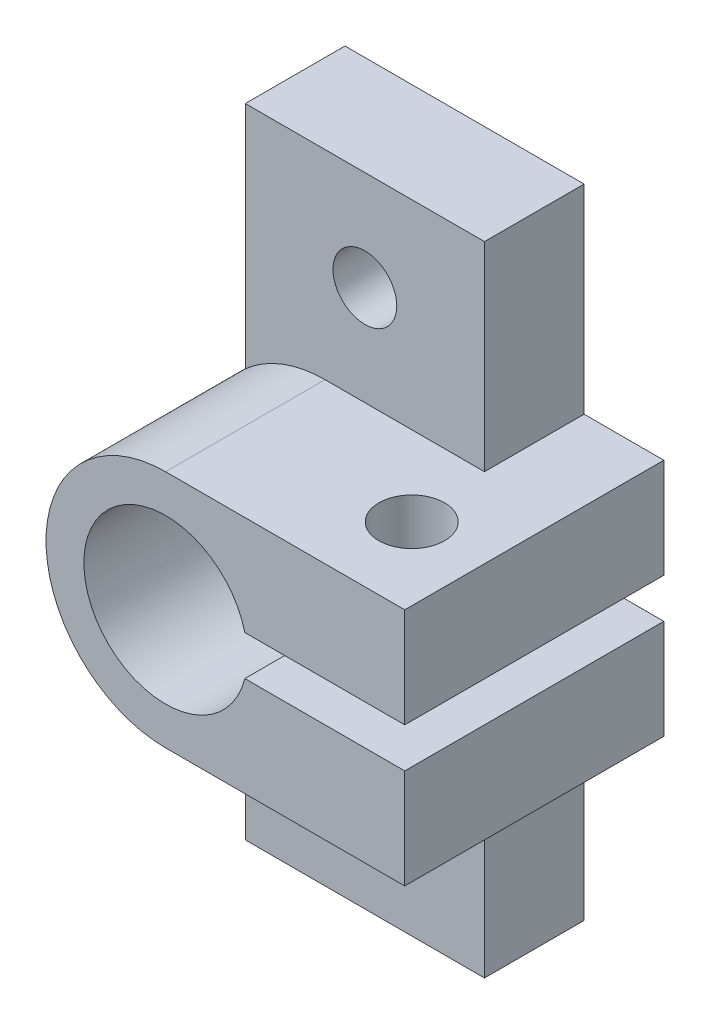
ISO-10303-21;
HEADER;
FILE_DESCRIPTION(('STEP AP214'),'2;1');
FILE_NAME('part.step','',(''),(''),'','','');
FILE_SCHEMA(('AUTOMOTIVE_DESIGN { 1 0 10303 214 1 1 1 1 }'));
ENDSEC;
DATA;
#1=APPLICATION_CONTEXT('core data for automotive mechanical design processes');
#2=APPLICATION_PROTOCOL_DEFINITION('international standard','automotive_design',2000,#1);
#3=PRODUCT_CONTEXT('',#1,'mechanical');
#4=PRODUCT('Part','Part','',(#3));
#5=PRODUCT_RELATED_PRODUCT_CATEGORY('part','',(#4));
#6=PRODUCT_DEFINITION_FORMATION('','',#4);
#7=PRODUCT_DEFINITION_CONTEXT('part definition',#1,'design');
#8=PRODUCT_DEFINITION('design','',#6,#7);
#9=PRODUCT_DEFINITION_SHAPE('','',#8);
#10=(LENGTH_UNIT() NAMED_UNIT(*) SI_UNIT(.MILLI.,.METRE.));
#11=(NAMED_UNIT(*) PLANE_ANGLE_UNIT() SI_UNIT($,.RADIAN.));
#12=(NAMED_UNIT(*) SI_UNIT($,.STERADIAN.) SOLID_ANGLE_UNIT());
#13=UNCERTAINTY_MEASURE_WITH_UNIT(LENGTH_MEASURE(1.E-05),#10,'distance_accuracy_value','');
#14=(GEOMETRIC_REPRESENTATION_CONTEXT(3) GLOBAL_UNCERTAINTY_ASSIGNED_CONTEXT((#13)) GLOBAL_UNIT_ASSIGNED_CONTEXT((#10,
#11,#12)) REPRESENTATION_CONTEXT('',''));
#15=CARTESIAN_POINT('',(0.,0.,0.));
#16=DIRECTION('',(0.,0.,1.));
#17=DIRECTION('',(1.,0.,0.));
#18=AXIS2_PLACEMENT_3D('',#15,#16,#17);
#19=CARTESIAN_POINT('',(0.,0.,0.));
#20=DIRECTION('',(0.,0.,1.));
#21=DIRECTION('',(1.,0.,0.));
#22=AXIS2_PLACEMENT_3D('',#19,#20,#21);
#23=CYLINDRICAL_SURFACE('',#22,6.);
#24=CARTESIAN_POINT('',(0.,0.,5.));
#25=DIRECTION('',(0.,0.,1.));
#26=DIRECTION('',(1.,0.,0.));
#27=AXIS2_PLACEMENT_3D('',#24,#25,#26);
#28=CIRCLE('',#27,6.);
#29=CARTESIAN_POINT('',(-4.,4.47213595499958,5.));
#30=VERTEX_POINT('',#29);
#31=CARTESIAN_POINT('',(0.,6.,5.));
#32=VERTEX_POINT('',#31);
#33=EDGE_CURVE('E49',#30,#32,#28,.F.);
#34=ORIENTED_EDGE('',*,*,#33,.F.);
#35=DIRECTION('',(0.,0.,1.));
#36=VECTOR('',#35,1.);
#37=CARTESIAN_POINT('',(-4.,4.47213595499958,0.));
#38=LINE('',#37,#36);
#39=CARTESIAN_POINT('',(-4.,4.47213595499958,0.));
#40=VERTEX_POINT('',#39);
#41=EDGE_CURVE('E11',#30,#40,#38,.F.);
#42=ORIENTED_EDGE('',*,*,#41,.T.);
#43=CARTESIAN_POINT('',(0.,0.,0.));
#44=DIRECTION('',(0.,0.,1.));
#45=DIRECTION('',(-1.,0.,0.));
#46=AXIS2_PLACEMENT_3D('',#43,#44,#45);
#47=CIRCLE('',#46,6.);
#48=CARTESIAN_POINT('',(-4.,-4.47213595499958,0.));
#49=VERTEX_POINT('',#48);
#50=EDGE_CURVE('E213',#40,#49,#47,.T.);
#51=ORIENTED_EDGE('',*,*,#50,.T.);
#52=DIRECTION('',(0.,0.,1.));
#53=VECTOR('',#52,1.);
#54=CARTESIAN_POINT('',(-4.,-4.47213595499958,0.));
#55=LINE('',#54,#53);
#56=CARTESIAN_POINT('',(-4.,-4.47213595499958,5.));
#57=VERTEX_POINT('',#56);
#58=EDGE_CURVE('E250',#57,#49,#55,.F.);
#59=ORIENTED_EDGE('',*,*,#58,.F.);
#60=CARTESIAN_POINT('',(0.,0.,5.));
#61=DIRECTION('',(0.,0.,1.));
#62=DIRECTION('',(1.,0.,0.));
#63=AXIS2_PLACEMENT_3D('',#60,#61,#62);
#64=CIRCLE('',#63,6.);
#65=CARTESIAN_POINT('',(0.,-6.,5.));
#66=VERTEX_POINT('',#65);
#67=EDGE_CURVE('E247',#57,#66,#64,.T.);
#68=ORIENTED_EDGE('',*,*,#67,.T.);
#69=DIRECTION('',(0.,0.,1.));
#70=VECTOR('',#69,1.);
#71=CARTESIAN_POINT('',(0.,-6.,0.));
#72=LINE('',#71,#70);
#73=CARTESIAN_POINT('',(0.,-6.,13.));
#74=VERTEX_POINT('',#73);
#75=EDGE_CURVE('E227',#66,#74,#72,.T.);
#76=ORIENTED_EDGE('',*,*,#75,.T.);
#77=CARTESIAN_POINT('',(0.,0.,13.));
#78=DIRECTION('',(0.,0.,1.));
#79=DIRECTION('',(-1.,0.,0.));
#80=AXIS2_PLACEMENT_3D('',#77,#78,#79);
#81=CIRCLE('',#80,6.);
#82=CARTESIAN_POINT('',(0.,6.,13.));
#83=VERTEX_POINT('',#82);
#84=EDGE_CURVE('E189',#83,#74,#81,.T.);
#85=ORIENTED_EDGE('',*,*,#84,.F.);
#86=DIRECTION('',(0.,0.,1.));
#87=VECTOR('',#86,1.);
#88=CARTESIAN_POINT('',(0.,6.,0.));
#89=LINE('',#88,#87);
#90=EDGE_CURVE('E228',#32,#83,#89,.T.);
#91=ORIENTED_EDGE('',*,*,#90,.F.);
#92=EDGE_LOOP('',(#34,#42,#51,#59,#68,#76,#85,#91));
#93=FACE_BOUND('',#92,.T.);
#94=ADVANCED_FACE('F34',(#93),#23,.T.);
#95=CARTESIAN_POINT('',(12.,6.,0.));
#96=DIRECTION('',(0.,1.,0.));
#97=DIRECTION('',(-1.,0.,0.));
#98=AXIS2_PLACEMENT_3D('',#95,#96,#97);
#99=PLANE('',#98);
#100=CARTESIAN_POINT('',(8.35,6.,9.));
#101=DIRECTION('',(0.,1.,0.));
#102=DIRECTION('',(-1.,0.,0.));
#103=AXIS2_PLACEMENT_3D('',#100,#101,#102);
#104=CIRCLE('',#103,1.65);
#105=CARTESIAN_POINT('',(6.7,6.,9.));
#106=VERTEX_POINT('',#105);
#107=EDGE_CURVE('E177',#106,#106,#104,.T.);
#108=ORIENTED_EDGE('',*,*,#107,.F.);
#109=EDGE_LOOP('',(#108));
#110=FACE_BOUND('',#109,.T.);
#111=DIRECTION('',(-1.,0.,0.));
#112=VECTOR('',#111,1.);
#113=CARTESIAN_POINT('',(12.,6.,0.));
#114=LINE('',#113,#112);
#115=CARTESIAN_POINT('',(12.,6.,0.));
#116=VERTEX_POINT('',#115);
#117=CARTESIAN_POINT('',(8.,6.,0.));
#118=VERTEX_POINT('',#117);
#119=EDGE_CURVE('E225',#116,#118,#114,.T.);
#120=ORIENTED_EDGE('',*,*,#119,.T.);
#121=DIRECTION('',(0.,0.,1.));
#122=VECTOR('',#121,1.);
#123=CARTESIAN_POINT('',(8.,6.,0.));
#124=LINE('',#123,#122);
#125=CARTESIAN_POINT('',(8.,6.,5.));
#126=VERTEX_POINT('',#125);
#127=EDGE_CURVE('E187',#118,#126,#124,.T.);
#128=ORIENTED_EDGE('',*,*,#127,.T.);
#129=DIRECTION('',(1.,0.,0.));
#130=VECTOR('',#129,1.);
#131=CARTESIAN_POINT('',(12.,6.,5.));
#132=LINE('',#131,#130);
#133=EDGE_CURVE('E152',#32,#126,#132,.T.);
#134=ORIENTED_EDGE('',*,*,#133,.F.);
#135=ORIENTED_EDGE('',*,*,#90,.T.);
#136=DIRECTION('',(-1.,0.,0.));
#137=VECTOR('',#136,1.);
#138=CARTESIAN_POINT('',(12.,6.,13.));
#139=LINE('',#138,#137);
#140=CARTESIAN_POINT('',(12.,6.,13.));
#141=VERTEX_POINT('',#140);
#142=EDGE_CURVE('E210',#141,#83,#139,.T.);
#143=ORIENTED_EDGE('',*,*,#142,.F.);
#144=DIRECTION('',(0.,0.,1.));
#145=VECTOR('',#144,1.);
#146=CARTESIAN_POINT('',(12.,6.,0.));
#147=LINE('',#146,#145);
#148=EDGE_CURVE('E231',#116,#141,#147,.T.);
#149=ORIENTED_EDGE('',*,*,#148,.F.);
#150=EDGE_LOOP('',(#120,#128,#134,#135,#143,#149));
#151=FACE_BOUND('',#150,.T.);
#152=ADVANCED_FACE('F318',(#110,#151),#99,.T.);
#153=CARTESIAN_POINT('',(0.,0.,5.));
#154=DIRECTION('',(0.,0.,-1.));
#155=DIRECTION('',(-1.,0.,0.));
#156=AXIS2_PLACEMENT_3D('',#153,#154,#155);
#157=CYLINDRICAL_SURFACE('',#156,4.1);
#158=DIRECTION('',(0.,0.,-1.));
#159=VECTOR('',#158,1.);
#160=CARTESIAN_POINT('',(3.97617907041421,-1.,5.));
#161=LINE('',#160,#159);
#162=CARTESIAN_POINT('',(3.97617907041421,-1.,13.));
#163=VERTEX_POINT('',#162);
#164=CARTESIAN_POINT('',(3.97617907041421,-1.,0.));
#165=VERTEX_POINT('',#164);
#166=EDGE_CURVE('E265',#163,#165,#161,.T.);
#167=ORIENTED_EDGE('',*,*,#166,.T.);
#168=CARTESIAN_POINT('',(0.,0.,0.));
#169=DIRECTION('',(0.,0.,1.));
#170=DIRECTION('',(1.,0.,0.));
#171=AXIS2_PLACEMENT_3D('',#168,#169,#170);
#172=CIRCLE('',#171,4.1);
#173=CARTESIAN_POINT('',(3.97617907041421,1.,0.));
#174=VERTEX_POINT('',#173);
#175=EDGE_CURVE('E253',#174,#165,#172,.T.);
#176=ORIENTED_EDGE('',*,*,#175,.F.);
#177=DIRECTION('',(0.,0.,1.));
#178=VECTOR('',#177,1.);
#179=CARTESIAN_POINT('',(3.97617907041421,1.,0.));
#180=LINE('',#179,#178);
#181=CARTESIAN_POINT('',(3.97617907041421,1.,13.));
#182=VERTEX_POINT('',#181);
#183=EDGE_CURVE('E235',#174,#182,#180,.T.);
#184=ORIENTED_EDGE('',*,*,#183,.T.);
#185=CARTESIAN_POINT('',(0.,0.,13.));
#186=DIRECTION('',(0.,0.,-1.));
#187=DIRECTION('',(1.,0.,0.));
#188=AXIS2_PLACEMENT_3D('',#185,#186,#187);
#189=CIRCLE('',#188,4.1);
#190=EDGE_CURVE('E201',#163,#182,#189,.T.);
#191=ORIENTED_EDGE('',*,*,#190,.F.);
#192=EDGE_LOOP('',(#167,#176,#184,#191));
#193=FACE_BOUND('',#192,.T.);
#194=ADVANCED_FACE('F36',(#193),#157,.F.);
#195=CARTESIAN_POINT('',(-4.,0.,5.));
#196=DIRECTION('',(1.,0.,0.));
#197=DIRECTION('',(0.,0.,-1.));
#198=AXIS2_PLACEMENT_3D('',#195,#196,#197);
#199=PLANE('',#198);
#200=DIRECTION('',(0.,-1.,0.));
#201=VECTOR('',#200,1.);
#202=CARTESIAN_POINT('',(-4.,0.,5.));
#203=LINE('',#202,#201);
#204=CARTESIAN_POINT('',(-4.,-16.,5.));
#205=VERTEX_POINT('',#204);
#206=EDGE_CURVE('E254',#57,#205,#203,.T.);
#207=ORIENTED_EDGE('',*,*,#206,.F.);
#208=ORIENTED_EDGE('',*,*,#58,.T.);
#209=DIRECTION('',(0.,-1.,0.));
#210=VECTOR('',#209,1.);
#211=CARTESIAN_POINT('',(-4.,0.,0.));
#212=LINE('',#211,#210);
#213=CARTESIAN_POINT('',(-4.,-16.,0.));
#214=VERTEX_POINT('',#213);
#215=EDGE_CURVE('E267',#49,#214,#212,.T.);
#216=ORIENTED_EDGE('',*,*,#215,.T.);
#217=DIRECTION('',(0.,0.,-1.));
#218=VECTOR('',#217,1.);
#219=CARTESIAN_POINT('',(-4.,-16.,5.));
#220=LINE('',#219,#218);
#221=EDGE_CURVE('E43',#205,#214,#220,.T.);
#222=ORIENTED_EDGE('',*,*,#221,.F.);
#223=EDGE_LOOP('',(#207,#208,#216,#222));
#224=FACE_BOUND('',#223,.T.);
#225=ADVANCED_FACE('F311',(#224),#199,.F.);
#226=CARTESIAN_POINT('',(0.,-16.,5.));
#227=DIRECTION('',(0.,-1.,0.));
#228=DIRECTION('',(0.,0.,-1.));
#229=AXIS2_PLACEMENT_3D('',#226,#227,#228);
#230=PLANE('',#229);
#231=DIRECTION('',(-1.,0.,0.));
#232=VECTOR('',#231,1.);
#233=CARTESIAN_POINT('',(0.,-16.,0.));
#234=LINE('',#233,#232);
#235=CARTESIAN_POINT('',(8.,-16.,0.));
#236=VERTEX_POINT('',#235);
#237=EDGE_CURVE('E269',#236,#214,#234,.T.);
#238=ORIENTED_EDGE('',*,*,#237,.F.);
#239=DIRECTION('',(0.,0.,-1.));
#240=VECTOR('',#239,1.);
#241=CARTESIAN_POINT('',(8.,-16.,5.));
#242=LINE('',#241,#240);
#243=CARTESIAN_POINT('',(8.,-16.,5.));
#244=VERTEX_POINT('',#243);
#245=EDGE_CURVE('E280',#244,#236,#242,.T.);
#246=ORIENTED_EDGE('',*,*,#245,.F.);
#247=DIRECTION('',(-1.,0.,0.));
#248=VECTOR('',#247,1.);
#249=CARTESIAN_POINT('',(0.,-16.,5.));
#250=LINE('',#249,#248);
#251=EDGE_CURVE('E256',#244,#205,#250,.T.);
#252=ORIENTED_EDGE('',*,*,#251,.T.);
#253=ORIENTED_EDGE('',*,*,#221,.T.);
#254=EDGE_LOOP('',(#238,#246,#252,#253));
#255=FACE_BOUND('',#254,.T.);
#256=ADVANCED_FACE('F286',(#255),#230,.T.);
#257=CARTESIAN_POINT('',(8.,0.,5.));
#258=DIRECTION('',(-1.,0.,0.));
#259=DIRECTION('',(0.,-1.,0.));
#260=AXIS2_PLACEMENT_3D('',#257,#258,#259);
#261=PLANE('',#260);
#262=DIRECTION('',(0.,1.,0.));
#263=VECTOR('',#262,1.);
#264=CARTESIAN_POINT('',(8.,0.,0.));
#265=LINE('',#264,#263);
#266=CARTESIAN_POINT('',(8.,-6.,0.));
#267=VERTEX_POINT('',#266);
#268=EDGE_CURVE('E272',#236,#267,#265,.T.);
#269=ORIENTED_EDGE('',*,*,#268,.T.);
#270=DIRECTION('',(0.,0.,1.));
#271=VECTOR('',#270,1.);
#272=CARTESIAN_POINT('',(8.,-6.,5.));
#273=LINE('',#272,#271);
#274=CARTESIAN_POINT('',(8.,-6.,5.));
#275=VERTEX_POINT('',#274);
#276=EDGE_CURVE('E244',#267,#275,#273,.T.);
#277=ORIENTED_EDGE('',*,*,#276,.T.);
#278=DIRECTION('',(0.,1.,0.));
#279=VECTOR('',#278,1.);
#280=CARTESIAN_POINT('',(8.,0.,5.));
#281=LINE('',#280,#279);
#282=EDGE_CURVE('E260',#244,#275,#281,.T.);
#283=ORIENTED_EDGE('',*,*,#282,.F.);
#284=ORIENTED_EDGE('',*,*,#245,.T.);
#285=EDGE_LOOP('',(#269,#277,#283,#284));
#286=FACE_BOUND('',#285,.T.);
#287=ADVANCED_FACE('F299',(#286),#261,.F.);
#288=CARTESIAN_POINT('',(0.,-1.,5.));
#289=DIRECTION('',(0.,1.,0.));
#290=DIRECTION('',(0.,0.,1.));
#291=AXIS2_PLACEMENT_3D('',#288,#289,#290);
#292=PLANE('',#291);
#293=CARTESIAN_POINT('',(8.35,-1.,9.));
#294=DIRECTION('',(0.,1.,0.));
#295=DIRECTION('',(0.,0.,1.));
#296=AXIS2_PLACEMENT_3D('',#293,#294,#295);
#297=CIRCLE('',#296,1.65);
#298=CARTESIAN_POINT('',(8.35,-1.,10.65));
#299=VERTEX_POINT('',#298);
#300=EDGE_CURVE('E525',#299,#299,#297,.T.);
#301=ORIENTED_EDGE('',*,*,#300,.F.);
#302=EDGE_LOOP('',(#301));
#303=FACE_BOUND('',#302,.T.);
#304=DIRECTION('',(0.,0.,1.));
#305=VECTOR('',#304,1.);
#306=CARTESIAN_POINT('',(12.,-1.,0.));
#307=LINE('',#306,#305);
#308=CARTESIAN_POINT('',(12.,-1.,0.));
#309=VERTEX_POINT('',#308);
#310=CARTESIAN_POINT('',(12.,-1.,13.));
#311=VERTEX_POINT('',#310);
#312=EDGE_CURVE('E237',#309,#311,#307,.T.);
#313=ORIENTED_EDGE('',*,*,#312,.F.);
#314=DIRECTION('',(1.,0.,0.));
#315=VECTOR('',#314,1.);
#316=CARTESIAN_POINT('',(0.,-1.,0.));
#317=LINE('',#316,#315);
#318=EDGE_CURVE('E274',#165,#309,#317,.T.);
#319=ORIENTED_EDGE('',*,*,#318,.F.);
#320=ORIENTED_EDGE('',*,*,#166,.F.);
#321=DIRECTION('',(-1.,0.,0.));
#322=VECTOR('',#321,1.);
#323=CARTESIAN_POINT('',(12.,-1.,13.));
#324=LINE('',#323,#322);
#325=EDGE_CURVE('E198',#311,#163,#324,.T.);
#326=ORIENTED_EDGE('',*,*,#325,.F.);
#327=EDGE_LOOP('',(#313,#319,#320,#326));
#328=FACE_BOUND('',#327,.T.);
#329=ADVANCED_FACE('F337',(#303,#328),#292,.T.);
#330=CARTESIAN_POINT('',(2.,-11.,5.));
#331=DIRECTION('',(0.,0.,-1.));
#332=DIRECTION('',(-1.,0.,0.));
#333=AXIS2_PLACEMENT_3D('',#330,#331,#332);
#334=CYLINDRICAL_SURFACE('',#333,1.6);
#335=CARTESIAN_POINT('',(2.,-11.,5.));
#336=DIRECTION('',(0.,0.,1.));
#337=DIRECTION('',(1.,0.,0.));
#338=AXIS2_PLACEMENT_3D('',#335,#336,#337);
#339=CIRCLE('',#338,1.6);
#340=CARTESIAN_POINT('',(3.6,-11.,5.));
#341=VERTEX_POINT('',#340);
#342=EDGE_CURVE('E262',#341,#341,#339,.T.);
#343=ORIENTED_EDGE('',*,*,#342,.T.);
#344=EDGE_LOOP('',(#343));
#345=FACE_BOUND('',#344,.T.);
#346=CARTESIAN_POINT('',(2.,-11.,0.));
#347=DIRECTION('',(0.,0.,1.));
#348=DIRECTION('',(1.,0.,0.));
#349=AXIS2_PLACEMENT_3D('',#346,#347,#348);
#350=CIRCLE('',#349,1.6);
#351=CARTESIAN_POINT('',(3.6,-11.,0.));
#352=VERTEX_POINT('',#351);
#353=EDGE_CURVE('E257',#352,#352,#350,.T.);
#354=ORIENTED_EDGE('',*,*,#353,.F.);
#355=EDGE_LOOP('',(#354));
#356=FACE_BOUND('',#355,.T.);
#357=ADVANCED_FACE('F332',(#345,#356),#334,.F.);
#358=CARTESIAN_POINT('',(0.,0.,5.));
#359=DIRECTION('',(0.,0.,1.));
#360=DIRECTION('',(1.,0.,0.));
#361=AXIS2_PLACEMENT_3D('',#358,#359,#360);
#362=PLANE('',#361);
#363=ORIENTED_EDGE('',*,*,#67,.F.);
#364=ORIENTED_EDGE('',*,*,#206,.T.);
#365=ORIENTED_EDGE('',*,*,#251,.F.);
#366=ORIENTED_EDGE('',*,*,#282,.T.);
#367=DIRECTION('',(1.,0.,0.));
#368=VECTOR('',#367,1.);
#369=CARTESIAN_POINT('',(0.,-6.,5.));
#370=LINE('',#369,#368);
#371=EDGE_CURVE('E230',#66,#275,#370,.T.);
#372=ORIENTED_EDGE('',*,*,#371,.F.);
#373=EDGE_LOOP('',(#363,#364,#365,#366,#372));
#374=FACE_BOUND('',#373,.T.);
#375=ORIENTED_EDGE('',*,*,#342,.F.);
#376=EDGE_LOOP('',(#375));
#377=FACE_BOUND('',#376,.T.);
#378=ADVANCED_FACE('F307',(#374,#377),#362,.T.);
#379=CARTESIAN_POINT('',(0.,0.,0.));
#380=DIRECTION('',(0.,0.,1.));
#381=DIRECTION('',(1.,0.,0.));
#382=AXIS2_PLACEMENT_3D('',#379,#380,#381);
#383=PLANE('',#382);
#384=ORIENTED_EDGE('',*,*,#175,.T.);
#385=ORIENTED_EDGE('',*,*,#318,.T.);
#386=DIRECTION('',(0.,1.,0.));
#387=VECTOR('',#386,1.);
#388=CARTESIAN_POINT('',(12.,-1.,0.));
#389=LINE('',#388,#387);
#390=CARTESIAN_POINT('',(12.,-6.,0.));
#391=VERTEX_POINT('',#390);
#392=EDGE_CURVE('E217',#391,#309,#389,.T.);
#393=ORIENTED_EDGE('',*,*,#392,.F.);
#394=DIRECTION('',(1.,0.,0.));
#395=VECTOR('',#394,1.);
#396=CARTESIAN_POINT('',(12.,-6.,0.));
#397=LINE('',#396,#395);
#398=EDGE_CURVE('E215',#267,#391,#397,.T.);
#399=ORIENTED_EDGE('',*,*,#398,.F.);
#400=ORIENTED_EDGE('',*,*,#268,.F.);
#401=ORIENTED_EDGE('',*,*,#237,.T.);
#402=ORIENTED_EDGE('',*,*,#215,.F.);
#403=ORIENTED_EDGE('',*,*,#50,.F.);
#404=DIRECTION('',(0.,-1.,0.));
#405=VECTOR('',#404,1.);
#406=CARTESIAN_POINT('',(-4.,0.,0.));
#407=LINE('',#406,#405);
#408=CARTESIAN_POINT('',(-4.,16.,0.));
#409=VERTEX_POINT('',#408);
#410=EDGE_CURVE('E181',#409,#40,#407,.T.);
#411=ORIENTED_EDGE('',*,*,#410,.F.);
#412=DIRECTION('',(1.,0.,0.));
#413=VECTOR('',#412,1.);
#414=CARTESIAN_POINT('',(0.,16.,0.));
#415=LINE('',#414,#413);
#416=CARTESIAN_POINT('',(8.,16.,0.));
#417=VERTEX_POINT('',#416);
#418=EDGE_CURVE('E179',#409,#417,#415,.T.);
#419=ORIENTED_EDGE('',*,*,#418,.T.);
#420=DIRECTION('',(0.,1.,0.));
#421=VECTOR('',#420,1.);
#422=CARTESIAN_POINT('',(8.,0.,0.));
#423=LINE('',#422,#421);
#424=EDGE_CURVE('E161',#118,#417,#423,.T.);
#425=ORIENTED_EDGE('',*,*,#424,.F.);
#426=ORIENTED_EDGE('',*,*,#119,.F.);
#427=DIRECTION('',(0.,1.,0.));
#428=VECTOR('',#427,1.);
#429=CARTESIAN_POINT('',(12.,6.,0.));
#430=LINE('',#429,#428);
#431=CARTESIAN_POINT('',(12.,1.,0.));
#432=VERTEX_POINT('',#431);
#433=EDGE_CURVE('E222',#432,#116,#430,.T.);
#434=ORIENTED_EDGE('',*,*,#433,.F.);
#435=DIRECTION('',(1.,0.,0.));
#436=VECTOR('',#435,1.);
#437=CARTESIAN_POINT('',(3.97617907041421,1.,0.));
#438=LINE('',#437,#436);
#439=EDGE_CURVE('E220',#174,#432,#438,.T.);
#440=ORIENTED_EDGE('',*,*,#439,.F.);
#441=EDGE_LOOP('',(#384,#385,#393,#399,#400,#401,#402,#403,#411,#419,#425,#426,#434,#440));
#442=FACE_BOUND('',#441,.T.);
#443=CARTESIAN_POINT('',(2.,11.,0.));
#444=DIRECTION('',(0.,0.,1.));
#445=DIRECTION('',(1.,0.,0.));
#446=AXIS2_PLACEMENT_3D('',#443,#444,#445);
#447=CIRCLE('',#446,1.6);
#448=CARTESIAN_POINT('',(3.6,11.,0.));
#449=VERTEX_POINT('',#448);
#450=EDGE_CURVE('E174',#449,#449,#447,.T.);
#451=ORIENTED_EDGE('',*,*,#450,.T.);
#452=EDGE_LOOP('',(#451));
#453=FACE_BOUND('',#452,.T.);
#454=ORIENTED_EDGE('',*,*,#353,.T.);
#455=EDGE_LOOP('',(#454));
#456=FACE_BOUND('',#455,.T.);
#457=ADVANCED_FACE('F293',(#442,#453,#456),#383,.F.);
#458=CARTESIAN_POINT('',(12.,-6.,0.));
#459=DIRECTION('',(0.,-1.,0.));
#460=DIRECTION('',(1.,0.,0.));
#461=AXIS2_PLACEMENT_3D('',#458,#459,#460);
#462=PLANE('',#461);
#463=CARTESIAN_POINT('',(8.35,-6.,9.));
#464=DIRECTION('',(0.,-1.,0.));
#465=DIRECTION('',(1.,0.,0.));
#466=AXIS2_PLACEMENT_3D('',#463,#464,#465);
#467=CIRCLE('',#466,1.65);
#468=CARTESIAN_POINT('',(10.,-6.,9.));
#469=VERTEX_POINT('',#468);
#470=EDGE_CURVE('E528',#469,#469,#467,.T.);
#471=ORIENTED_EDGE('',*,*,#470,.F.);
#472=EDGE_LOOP('',(#471));
#473=FACE_BOUND('',#472,.T.);
#474=ORIENTED_EDGE('',*,*,#276,.F.);
#475=ORIENTED_EDGE('',*,*,#398,.T.);
#476=DIRECTION('',(0.,0.,1.));
#477=VECTOR('',#476,1.);
#478=CARTESIAN_POINT('',(12.,-6.,0.));
#479=LINE('',#478,#477);
#480=CARTESIAN_POINT('',(12.,-6.,13.));
#481=VERTEX_POINT('',#480);
#482=EDGE_CURVE('E239',#391,#481,#479,.T.);
#483=ORIENTED_EDGE('',*,*,#482,.T.);
#484=DIRECTION('',(1.,0.,0.));
#485=VECTOR('',#484,1.);
#486=CARTESIAN_POINT('',(12.,-6.,13.));
#487=LINE('',#486,#485);
#488=EDGE_CURVE('E192',#74,#481,#487,.T.);
#489=ORIENTED_EDGE('',*,*,#488,.F.);
#490=ORIENTED_EDGE('',*,*,#75,.F.);
#491=ORIENTED_EDGE('',*,*,#371,.T.);
#492=EDGE_LOOP('',(#474,#475,#483,#489,#490,#491));
#493=FACE_BOUND('',#492,.T.);
#494=ADVANCED_FACE('F302',(#473,#493),#462,.T.);
#495=CARTESIAN_POINT('',(12.,6.,0.));
#496=DIRECTION('',(1.,0.,0.));
#497=DIRECTION('',(0.,1.,0.));
#498=AXIS2_PLACEMENT_3D('',#495,#496,#497);
#499=PLANE('',#498);
#500=ORIENTED_EDGE('',*,*,#148,.T.);
#501=DIRECTION('',(0.,1.,0.));
#502=VECTOR('',#501,1.);
#503=CARTESIAN_POINT('',(12.,6.,13.));
#504=LINE('',#503,#502);
#505=CARTESIAN_POINT('',(12.,1.,13.));
#506=VERTEX_POINT('',#505);
#507=EDGE_CURVE('E207',#506,#141,#504,.T.);
#508=ORIENTED_EDGE('',*,*,#507,.F.);
#509=DIRECTION('',(0.,0.,1.));
#510=VECTOR('',#509,1.);
#511=CARTESIAN_POINT('',(12.,1.,0.));
#512=LINE('',#511,#510);
#513=EDGE_CURVE('E233',#432,#506,#512,.T.);
#514=ORIENTED_EDGE('',*,*,#513,.F.);
#515=ORIENTED_EDGE('',*,*,#433,.T.);
#516=EDGE_LOOP('',(#500,#508,#514,#515));
#517=FACE_BOUND('',#516,.T.);
#518=ADVANCED_FACE('F371',(#517),#499,.T.);
#519=CARTESIAN_POINT('',(3.97617907041421,1.,0.));
#520=DIRECTION('',(0.,-1.,0.));
#521=DIRECTION('',(0.,0.,-1.));
#522=AXIS2_PLACEMENT_3D('',#519,#520,#521);
#523=PLANE('',#522);
#524=CARTESIAN_POINT('',(8.35,0.999999999999999,9.));
#525=DIRECTION('',(0.,-1.,0.));
#526=DIRECTION('',(0.,0.,-1.));
#527=AXIS2_PLACEMENT_3D('',#524,#525,#526);
#528=CIRCLE('',#527,1.65);
#529=CARTESIAN_POINT('',(8.35,0.999999999999999,7.35));
#530=VERTEX_POINT('',#529);
#531=EDGE_CURVE('E38',#530,#530,#528,.T.);
#532=ORIENTED_EDGE('',*,*,#531,.F.);
#533=EDGE_LOOP('',(#532));
#534=FACE_BOUND('',#533,.T.);
#535=ORIENTED_EDGE('',*,*,#439,.T.);
#536=ORIENTED_EDGE('',*,*,#513,.T.);
#537=DIRECTION('',(1.,0.,0.));
#538=VECTOR('',#537,1.);
#539=CARTESIAN_POINT('',(3.97617907041421,1.,13.));
#540=LINE('',#539,#538);
#541=EDGE_CURVE('E204',#182,#506,#540,.T.);
#542=ORIENTED_EDGE('',*,*,#541,.F.);
#543=ORIENTED_EDGE('',*,*,#183,.F.);
#544=EDGE_LOOP('',(#535,#536,#542,#543));
#545=FACE_BOUND('',#544,.T.);
#546=ADVANCED_FACE('F378',(#534,#545),#523,.T.);
#547=CARTESIAN_POINT('',(12.,-1.,0.));
#548=DIRECTION('',(1.,0.,0.));
#549=DIRECTION('',(0.,1.,0.));
#550=AXIS2_PLACEMENT_3D('',#547,#548,#549);
#551=PLANE('',#550);
#552=ORIENTED_EDGE('',*,*,#312,.T.);
#553=DIRECTION('',(0.,1.,0.));
#554=VECTOR('',#553,1.);
#555=CARTESIAN_POINT('',(12.,-1.,13.));
#556=LINE('',#555,#554);
#557=EDGE_CURVE('E195',#481,#311,#556,.T.);
#558=ORIENTED_EDGE('',*,*,#557,.F.);
#559=ORIENTED_EDGE('',*,*,#482,.F.);
#560=ORIENTED_EDGE('',*,*,#392,.T.);
#561=EDGE_LOOP('',(#552,#558,#559,#560));
#562=FACE_BOUND('',#561,.T.);
#563=ADVANCED_FACE('F386',(#562),#551,.T.);
#564=CARTESIAN_POINT('',(0.,0.,13.));
#565=DIRECTION('',(0.,0.,-1.));
#566=DIRECTION('',(-1.,0.,0.));
#567=AXIS2_PLACEMENT_3D('',#564,#565,#566);
#568=PLANE('',#567);
#569=ORIENTED_EDGE('',*,*,#84,.T.);
#570=ORIENTED_EDGE('',*,*,#488,.T.);
#571=ORIENTED_EDGE('',*,*,#557,.T.);
#572=ORIENTED_EDGE('',*,*,#325,.T.);
#573=ORIENTED_EDGE('',*,*,#190,.T.);
#574=ORIENTED_EDGE('',*,*,#541,.T.);
#575=ORIENTED_EDGE('',*,*,#507,.T.);
#576=ORIENTED_EDGE('',*,*,#142,.T.);
#577=EDGE_LOOP('',(#569,#570,#571,#572,#573,#574,#575,#576));
#578=FACE_BOUND('',#577,.T.);
#579=ADVANCED_FACE('F394',(#578),#568,.F.);
#580=CARTESIAN_POINT('',(8.,0.,5.));
#581=DIRECTION('',(-1.,0.,0.));
#582=DIRECTION('',(0.,-1.,0.));
#583=AXIS2_PLACEMENT_3D('',#580,#581,#582);
#584=PLANE('',#583);
#585=ORIENTED_EDGE('',*,*,#127,.F.);
#586=ORIENTED_EDGE('',*,*,#424,.T.);
#587=DIRECTION('',(0.,0.,-1.));
#588=VECTOR('',#587,1.);
#589=CARTESIAN_POINT('',(8.,16.,5.));
#590=LINE('',#589,#588);
#591=CARTESIAN_POINT('',(8.,16.,5.));
#592=VERTEX_POINT('',#591);
#593=EDGE_CURVE('E158',#592,#417,#590,.T.);
#594=ORIENTED_EDGE('',*,*,#593,.F.);
#595=DIRECTION('',(0.,1.,0.));
#596=VECTOR('',#595,1.);
#597=CARTESIAN_POINT('',(8.,0.,5.));
#598=LINE('',#597,#596);
#599=EDGE_CURVE('E146',#126,#592,#598,.T.);
#600=ORIENTED_EDGE('',*,*,#599,.F.);
#601=EDGE_LOOP('',(#585,#586,#594,#600));
#602=FACE_BOUND('',#601,.T.);
#603=ADVANCED_FACE('F159',(#602),#584,.F.);
#604=CARTESIAN_POINT('',(0.,16.,5.));
#605=DIRECTION('',(0.,1.,0.));
#606=DIRECTION('',(0.,0.,1.));
#607=AXIS2_PLACEMENT_3D('',#604,#605,#606);
#608=PLANE('',#607);
#609=ORIENTED_EDGE('',*,*,#418,.F.);
#610=DIRECTION('',(0.,0.,-1.));
#611=VECTOR('',#610,1.);
#612=CARTESIAN_POINT('',(-4.,16.,5.));
#613=LINE('',#612,#611);
#614=CARTESIAN_POINT('',(-4.,16.,5.));
#615=VERTEX_POINT('',#614);
#616=EDGE_CURVE('E165',#615,#409,#613,.T.);
#617=ORIENTED_EDGE('',*,*,#616,.F.);
#618=DIRECTION('',(1.,0.,0.));
#619=VECTOR('',#618,1.);
#620=CARTESIAN_POINT('',(0.,16.,5.));
#621=LINE('',#620,#619);
#622=EDGE_CURVE('E151',#615,#592,#621,.T.);
#623=ORIENTED_EDGE('',*,*,#622,.T.);
#624=ORIENTED_EDGE('',*,*,#593,.T.);
#625=EDGE_LOOP('',(#609,#617,#623,#624));
#626=FACE_BOUND('',#625,.T.);
#627=ADVANCED_FACE('F167',(#626),#608,.T.);
#628=CARTESIAN_POINT('',(2.,11.,5.));
#629=DIRECTION('',(0.,0.,-1.));
#630=DIRECTION('',(-1.,0.,0.));
#631=AXIS2_PLACEMENT_3D('',#628,#629,#630);
#632=CYLINDRICAL_SURFACE('',#631,1.6);
#633=CARTESIAN_POINT('',(2.,11.,5.));
#634=DIRECTION('',(0.,0.,1.));
#635=DIRECTION('',(1.,0.,0.));
#636=AXIS2_PLACEMENT_3D('',#633,#634,#635);
#637=CIRCLE('',#636,1.6);
#638=CARTESIAN_POINT('',(3.6,11.,5.));
#639=VERTEX_POINT('',#638);
#640=EDGE_CURVE('E155',#639,#639,#637,.T.);
#641=ORIENTED_EDGE('',*,*,#640,.T.);
#642=EDGE_LOOP('',(#641));
#643=FACE_BOUND('',#642,.T.);
#644=ORIENTED_EDGE('',*,*,#450,.F.);
#645=EDGE_LOOP('',(#644));
#646=FACE_BOUND('',#645,.T.);
#647=ADVANCED_FACE('F414',(#643,#646),#632,.F.);
#648=CARTESIAN_POINT('',(-4.,0.,5.));
#649=DIRECTION('',(1.,0.,0.));
#650=DIRECTION('',(0.,0.,-1.));
#651=AXIS2_PLACEMENT_3D('',#648,#649,#650);
#652=PLANE('',#651);
#653=ORIENTED_EDGE('',*,*,#41,.F.);
#654=DIRECTION('',(0.,-1.,0.));
#655=VECTOR('',#654,1.);
#656=CARTESIAN_POINT('',(-4.,0.,5.));
#657=LINE('',#656,#655);
#658=EDGE_CURVE('E169',#615,#30,#657,.T.);
#659=ORIENTED_EDGE('',*,*,#658,.F.);
#660=ORIENTED_EDGE('',*,*,#616,.T.);
#661=ORIENTED_EDGE('',*,*,#410,.T.);
#662=EDGE_LOOP('',(#653,#659,#660,#661));
#663=FACE_BOUND('',#662,.T.);
#664=ADVANCED_FACE('F421',(#663),#652,.F.);
#665=CARTESIAN_POINT('',(0.,0.,5.));
#666=DIRECTION('',(0.,0.,1.));
#667=DIRECTION('',(1.,0.,0.));
#668=AXIS2_PLACEMENT_3D('',#665,#666,#667);
#669=PLANE('',#668);
#670=ORIENTED_EDGE('',*,*,#640,.F.);
#671=EDGE_LOOP('',(#670));
#672=FACE_BOUND('',#671,.T.);
#673=ORIENTED_EDGE('',*,*,#658,.T.);
#674=ORIENTED_EDGE('',*,*,#33,.T.);
#675=ORIENTED_EDGE('',*,*,#133,.T.);
#676=ORIENTED_EDGE('',*,*,#599,.T.);
#677=ORIENTED_EDGE('',*,*,#622,.F.);
#678=EDGE_LOOP('',(#673,#674,#675,#676,#677));
#679=FACE_BOUND('',#678,.T.);
#680=ADVANCED_FACE('F149',(#672,#679),#669,.T.);
#681=CARTESIAN_POINT('',(8.35,16.,9.));
#682=DIRECTION('',(0.,-1.,0.));
#683=DIRECTION('',(1.,0.,0.));
#684=AXIS2_PLACEMENT_3D('',#681,#682,#683);
#685=CYLINDRICAL_SURFACE('',#684,1.65);
#686=ORIENTED_EDGE('',*,*,#107,.T.);
#687=EDGE_LOOP('',(#686));
#688=FACE_BOUND('',#687,.T.);
#689=ORIENTED_EDGE('',*,*,#531,.T.);
#690=EDGE_LOOP('',(#689));
#691=FACE_BOUND('',#690,.T.);
#692=ADVANCED_FACE('F436',(#688,#691),#685,.F.);
#693=ORIENTED_EDGE('',*,*,#300,.T.);
#694=EDGE_LOOP('',(#693));
#695=FACE_BOUND('',#694,.T.);
#696=ORIENTED_EDGE('',*,*,#470,.T.);
#697=EDGE_LOOP('',(#696));
#698=FACE_BOUND('',#697,.T.);
#699=ADVANCED_FACE('F443',(#695,#698),#685,.F.);
#700=CLOSED_SHELL('',(#94,#152,#194,#225,#256,#287,#329,#357,#378,#457,#494,#518,#546,#563,#579,
#603,#627,#647,#664,#680,#692,#699));
#701=MANIFOLD_SOLID_BREP('B2',#700);
#702=ADVANCED_BREP_SHAPE_REPRESENTATION('',(#18,#701),#14);
#703=SHAPE_DEFINITION_REPRESENTATION(#9,#702);
ENDSEC;
END-ISO-10303-21;
